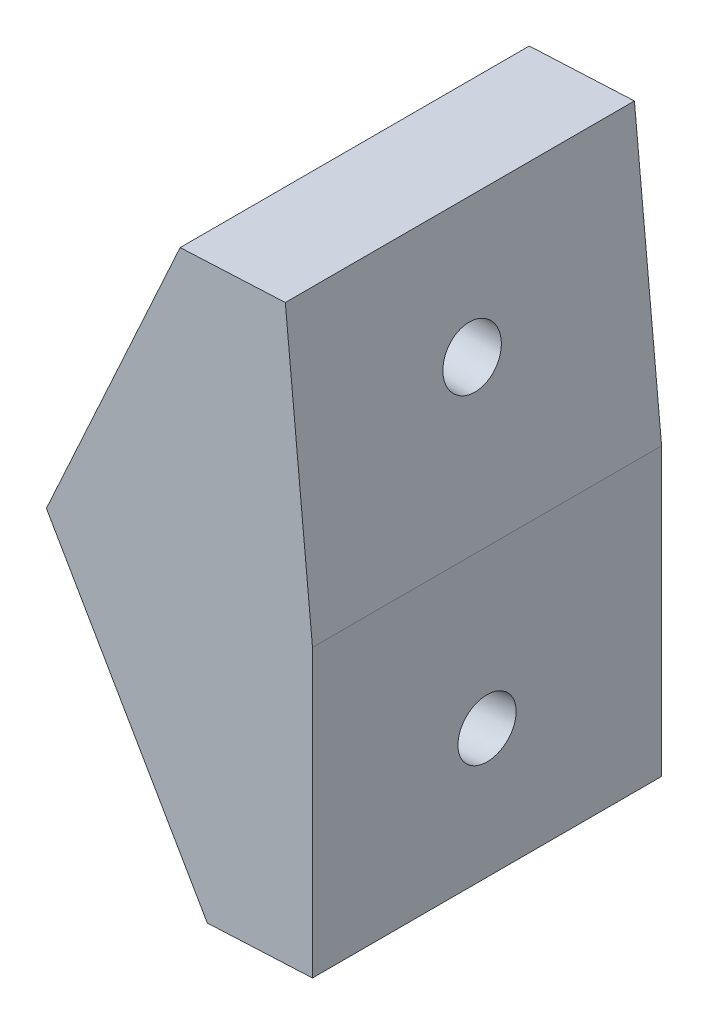
ISO-10303-21;
HEADER;
FILE_DESCRIPTION(('STEP AP214'),'2;1');
FILE_NAME('part.step','',(''),(''),'','','');
FILE_SCHEMA(('AUTOMOTIVE_DESIGN { 1 0 10303 214 1 1 1 1 }'));
ENDSEC;
DATA;
#1=APPLICATION_CONTEXT('core data for automotive mechanical design processes');
#2=APPLICATION_PROTOCOL_DEFINITION('international standard','automotive_design',2000,#1);
#3=PRODUCT_CONTEXT('',#1,'mechanical');
#4=PRODUCT('Part','Part','',(#3));
#5=PRODUCT_RELATED_PRODUCT_CATEGORY('part','',(#4));
#6=PRODUCT_DEFINITION_FORMATION('','',#4);
#7=PRODUCT_DEFINITION_CONTEXT('part definition',#1,'design');
#8=PRODUCT_DEFINITION('design','',#6,#7);
#9=PRODUCT_DEFINITION_SHAPE('','',#8);
#10=(LENGTH_UNIT() NAMED_UNIT(*) SI_UNIT(.MILLI.,.METRE.));
#11=(NAMED_UNIT(*) PLANE_ANGLE_UNIT() SI_UNIT($,.RADIAN.));
#12=(NAMED_UNIT(*) SI_UNIT($,.STERADIAN.) SOLID_ANGLE_UNIT());
#13=UNCERTAINTY_MEASURE_WITH_UNIT(LENGTH_MEASURE(1.E-05),#10,'distance_accuracy_value','');
#14=(GEOMETRIC_REPRESENTATION_CONTEXT(3) GLOBAL_UNCERTAINTY_ASSIGNED_CONTEXT((#13)) GLOBAL_UNIT_ASSIGNED_CONTEXT((#10,
#11,#12)) REPRESENTATION_CONTEXT('',''));
#15=CARTESIAN_POINT('',(0.,0.,0.));
#16=DIRECTION('',(0.,0.,1.));
#17=DIRECTION('',(1.,0.,0.));
#18=AXIS2_PLACEMENT_3D('',#15,#16,#17);
#19=CARTESIAN_POINT('',(-3.53030000000001,20.3447220636834,7.5));
#20=DIRECTION('',(-1.,0.,0.));
#21=DIRECTION('',(0.,-1.,0.));
#22=AXIS2_PLACEMENT_3D('',#19,#20,#21);
#23=PLANE('',#22);
#24=DIRECTION('',(0.,1.,0.));
#25=VECTOR('',#24,1.);
#26=CARTESIAN_POINT('',(-3.53030000000001,20.3447220636834,-7.5));
#27=LINE('',#26,#25);
#28=CARTESIAN_POINT('',(-3.5303,8.04169602348681,-7.5));
#29=VERTEX_POINT('',#28);
#30=CARTESIAN_POINT('',(-3.53030000000001,20.3447220636834,-7.5));
#31=VERTEX_POINT('',#30);
#32=EDGE_CURVE('E143',#29,#31,#27,.T.);
#33=ORIENTED_EDGE('',*,*,#32,.T.);
#34=DIRECTION('',(0.,0.,-1.));
#35=VECTOR('',#34,1.);
#36=CARTESIAN_POINT('',(-3.53030000000001,20.3447220636834,7.5));
#37=LINE('',#36,#35);
#38=CARTESIAN_POINT('',(-3.53030000000001,20.3447220636834,7.5));
#39=VERTEX_POINT('',#38);
#40=EDGE_CURVE('E140',#39,#31,#37,.T.);
#41=ORIENTED_EDGE('',*,*,#40,.F.);
#42=DIRECTION('',(0.,1.,0.));
#43=VECTOR('',#42,1.);
#44=CARTESIAN_POINT('',(-3.53030000000001,20.3447220636834,7.5));
#45=LINE('',#44,#43);
#46=CARTESIAN_POINT('',(-3.5303,8.04169602348681,7.5));
#47=VERTEX_POINT('',#46);
#48=EDGE_CURVE('E85',#47,#39,#45,.T.);
#49=ORIENTED_EDGE('',*,*,#48,.F.);
#50=DIRECTION('',(0.,0.,-1.));
#51=VECTOR('',#50,1.);
#52=CARTESIAN_POINT('',(-3.5303,8.04169602348681,7.5));
#53=LINE('',#52,#51);
#54=EDGE_CURVE('E52',#47,#29,#53,.T.);
#55=ORIENTED_EDGE('',*,*,#54,.T.);
#56=EDGE_LOOP('',(#33,#41,#49,#55));
#57=FACE_BOUND('',#56,.T.);
#58=CARTESIAN_POINT('',(-3.53029999999999,14.8337738265312,0.));
#59=CARTESIAN_POINT('',(-3.53029999999998,14.83377044408,0.0692359749450587));
#60=CARTESIAN_POINT('',(-3.53029999999998,14.82800026885,0.13854463497285));
#61=CARTESIAN_POINT('',(-3.53029999999999,14.8050706943426,0.275212221597939));
#62=CARTESIAN_POINT('',(-3.5303,14.7879112953292,0.342571148240443));
#63=CARTESIAN_POINT('',(-3.53029999999999,14.7426805167584,0.473530581182184));
#64=CARTESIAN_POINT('',(-3.53029999999998,14.7146091372099,0.537131087484525));
#65=CARTESIAN_POINT('',(-3.53029999999999,14.6483275840726,0.658806319649011));
#66=CARTESIAN_POINT('',(-3.53030000000002,14.6101174104955,0.716881045517602));
#67=CARTESIAN_POINT('',(-3.53030000000003,14.5246124435633,0.825906468855542));
#68=CARTESIAN_POINT('',(-3.5303,14.4773176502207,0.876857166334717));
#69=CARTESIAN_POINT('',(-3.53029999999999,14.3749478226641,0.970228300777369));
#70=CARTESIAN_POINT('',(-3.53030000000001,14.3198727884614,1.01264873775314));
#71=CARTESIAN_POINT('',(-3.53030000000002,14.2034615431487,1.08778959491427));
#72=CARTESIAN_POINT('',(-3.53030000000001,14.142125332047,1.12051001511267));
#73=CARTESIAN_POINT('',(-3.53030000000001,14.0148834613635,1.1753483006496));
#74=CARTESIAN_POINT('',(-3.53030000000001,13.9489778017867,1.19746616599979));
#75=CARTESIAN_POINT('',(-3.53030000000001,13.8144147998254,1.23048932199295));
#76=CARTESIAN_POINT('',(-3.53030000000001,13.7457574574429,1.24139461264418));
#77=CARTESIAN_POINT('',(-3.53030000000001,13.6075847479378,1.25169183310402));
#78=CARTESIAN_POINT('',(-3.5303,13.5380693808153,1.251083762916));
#79=CARTESIAN_POINT('',(-3.53029999999999,13.4000979455833,1.23837103432999));
#80=CARTESIAN_POINT('',(-3.53029999999998,13.3316418774741,1.22626637592988));
#81=CARTESIAN_POINT('',(-3.53029999999998,13.197677147345,1.1908943318853));
#82=CARTESIAN_POINT('',(-3.53029999999999,13.1321684853272,1.16762694623366));
#83=CARTESIAN_POINT('',(-3.5303,13.0059053819735,1.11057119105747));
#84=CARTESIAN_POINT('',(-3.5303,12.9451509406425,1.07678282152211));
#85=CARTESIAN_POINT('',(-3.5303,12.8300719666958,0.999617024174008));
#86=CARTESIAN_POINT('',(-3.5303,12.7757474340884,0.956239596348781));
#87=CARTESIAN_POINT('',(-3.5303,12.6750266214041,0.86109208724944));
#88=CARTESIAN_POINT('',(-3.5303,12.6286303413387,0.809322005963298));
#89=CARTESIAN_POINT('',(-3.5303,12.5450457067597,0.698817076073706));
#90=CARTESIAN_POINT('',(-3.53029999999999,12.507857352259,0.640082227460454));
#91=CARTESIAN_POINT('',(-3.53029999999998,12.4437142754655,0.517267747720645));
#92=CARTESIAN_POINT('',(-3.53029999999998,12.4167595531852,0.453188116587528));
#93=CARTESIAN_POINT('',(-3.53029999999999,12.3738271903862,0.32145147467509));
#94=CARTESIAN_POINT('',(-3.53029999999999,12.3578495497686,0.253794463928009));
#95=CARTESIAN_POINT('',(-3.53029999999998,12.3373120366163,0.11676913844667));
#96=CARTESIAN_POINT('',(-3.53029999999998,12.3327521633923,0.0474008238157425));
#97=CARTESIAN_POINT('',(-3.53029999999999,12.3351759508386,-0.0911338410326387));
#98=CARTESIAN_POINT('',(-3.53030000000001,12.3421596115093,-0.160300191250087));
#99=CARTESIAN_POINT('',(-3.53030000000001,12.3674778474107,-0.296523225390453));
#100=CARTESIAN_POINT('',(-3.5303,12.3858124226364,-0.363579909314306));
#101=CARTESIAN_POINT('',(-3.53029999999999,12.4333267940165,-0.493734097020736));
#102=CARTESIAN_POINT('',(-3.53029999999999,12.4625065901614,-0.556831600806745));
#103=CARTESIAN_POINT('',(-3.5303,12.5309065835864,-0.677327114878901));
#104=CARTESIAN_POINT('',(-3.53030000000001,12.5701267808545,-0.734725125171862));
#105=CARTESIAN_POINT('',(-3.53030000000001,12.6575258291469,-0.84223853969923));
#106=CARTESIAN_POINT('',(-3.5303,12.7057046801586,-0.892353943943785));
#107=CARTESIAN_POINT('',(-3.53029999999999,12.8096921975871,-0.983919898821573));
#108=CARTESIAN_POINT('',(-3.5303,12.8655008639928,-1.02537044946727));
#109=CARTESIAN_POINT('',(-3.5303,12.9832087344617,-1.09846343841363));
#110=CARTESIAN_POINT('',(-3.5303,13.0451079385167,-1.1301058767273));
#111=CARTESIAN_POINT('',(-3.5303,13.1732896226563,-1.18270990313287));
#112=CARTESIAN_POINT('',(-3.53029999999999,13.2395721027361,-1.20367149123618));
#113=CARTESIAN_POINT('',(-3.5303,13.3746921818933,-1.23433567080856));
#114=CARTESIAN_POINT('',(-3.53030000000001,13.443529780969,-1.24403826228543));
#115=CARTESIAN_POINT('',(-3.53030000000001,13.5818614681914,-1.25191683944832));
#116=CARTESIAN_POINT('',(-3.5303,13.6513555563379,-1.25009282513714));
#117=CARTESIAN_POINT('',(-3.53029999999999,13.7890834854926,-1.23496849873415));
#118=CARTESIAN_POINT('',(-3.5303,13.8573173265005,-1.22166818663966));
#119=CARTESIAN_POINT('',(-3.5303,13.9906427827779,-1.18395810552632));
#120=CARTESIAN_POINT('',(-3.5303,14.0557343980453,-1.15954833649986));
#121=CARTESIAN_POINT('',(-3.5303,14.1809800948796,-1.10029258567404));
#122=CARTESIAN_POINT('',(-3.5303,14.2411341764414,-1.06544660386359));
#123=CARTESIAN_POINT('',(-3.5303,14.3548456625534,-0.986279550979464));
#124=CARTESIAN_POINT('',(-3.5303,14.408403067095,-0.941958479893259));
#125=CARTESIAN_POINT('',(-3.5303,14.507444066479,-0.845063576805854));
#126=CARTESIAN_POINT('',(-3.5303,14.5529276613098,-0.792489744792787));
#127=CARTESIAN_POINT('',(-3.53029999999999,14.6345663450336,-0.680539759897578));
#128=CARTESIAN_POINT('',(-3.53029999999999,14.6707214339136,-0.621163607005943));
#129=CARTESIAN_POINT('',(-3.53029999999998,14.7327066309919,-0.497245214379639));
#130=CARTESIAN_POINT('',(-3.53029999999998,14.7585367391777,-0.432702974638769));
#131=CARTESIAN_POINT('',(-3.53030000000001,14.7968221512422,-0.307851428616006));
#132=CARTESIAN_POINT('',(-3.53030000000003,14.8104735895919,-0.247908385541222));
#133=CARTESIAN_POINT('',(-3.53030000000002,14.8243424429205,-0.156423425380291));
#134=CARTESIAN_POINT('',(-3.53030000000002,14.8278648106663,-0.125352889850853));
#135=CARTESIAN_POINT('',(-3.5303,14.8325879190164,-0.0628605600363315));
#136=CARTESIAN_POINT('',(-3.5303,14.8337753623908,-0.0314377730092758));
#137=CARTESIAN_POINT('',(-3.53029999999999,14.8337738265312,0.));
#138=B_SPLINE_CURVE_WITH_KNOTS('',3,(#58,#59,#60,#61,#62,#63,#64,#65,#66,#67,#68,#69,#70,#71,
#72,#73,#74,#75,#76,#77,#78,#79,#80,#81,#82,#83,#84,#85,#86,#87,#88,#89,#90,#91,#92,#93,#94,#95,
#96,#97,#98,#99,#100,#101,#102,#103,#104,#105,#106,#107,#108,#109,#110,#111,#112,#113,#114,#115,
#116,#117,#118,#119,#120,#121,#122,#123,#124,#125,#126,#127,#128,#129,#130,#131,#132,#133,#134,
#135,#136,#137),.UNSPECIFIED.,.T.,.F.,(4,2,2,2,2,2,2,2,2,2,2,2,2,2,2,2,2,2,2,2,2,2,2,2,2,2,2,2,
2,2,2,2,2,2,2,2,2,2,2,4),(0.,0.207595387613271,0.415190770413107,0.6227861530415,
0.83038153542772,1.03797691752757,1.24557229932822,1.45316768084964,1.66076306214237,
1.86835844328203,2.07595382436099,2.2835492054783,2.49114458672877,2.69873996819264,
2.90633534992677,3.11393073195841,3.32152611428222,3.52912149686082,3.73671687756856,
3.94431224574143,4.1519076139204,4.35950298200743,4.56709834991453,4.77469371757345,
4.98228908494311,5.18988445201415,5.3974798188099,5.60507518538387,5.81267055181385,
6.02026591819344,6.22786128462173,6.43545665119248,6.64305201798384,6.85064738504981,
7.05824275241428,7.26583812006845,7.47343348797176,7.65716557528975,7.75089553776605,
7.84515775735252),.UNSPECIFIED.);
#139=CARTESIAN_POINT('',(-3.53029999999999,14.8337738265312,0.));
#140=VERTEX_POINT('',#139);
#141=EDGE_CURVE('E158',#140,#140,#138,.T.);
#142=ORIENTED_EDGE('',*,*,#141,.F.);
#143=EDGE_LOOP('',(#142));
#144=FACE_BOUND('',#143,.T.);
#145=ADVANCED_FACE('F38',(#57,#144),#23,.F.);
#146=CARTESIAN_POINT('',(-8.04908347678806,7.82676257019965,7.5));
#147=DIRECTION('',(0.866025403784439,0.499999999999999,0.));
#148=DIRECTION('',(-0.499999999999999,0.866025403784439,0.));
#149=AXIS2_PLACEMENT_3D('',#146,#147,#148);
#150=PLANE('',#149);
#151=DIRECTION('',(0.499999999999999,-0.866025403784439,0.));
#152=VECTOR('',#151,1.);
#153=CARTESIAN_POINT('',(-8.04908347678806,7.82676257019965,-7.5));
#154=LINE('',#153,#152);
#155=CARTESIAN_POINT('',(-14.9625241732557,19.801193111596,-7.5));
#156=VERTEX_POINT('',#155);
#157=CARTESIAN_POINT('',(-8.04908347678806,7.82676257019965,-7.5));
#158=VERTEX_POINT('',#157);
#159=EDGE_CURVE('E75',#156,#158,#154,.T.);
#160=ORIENTED_EDGE('',*,*,#159,.T.);
#161=DIRECTION('',(0.,0.,-1.));
#162=VECTOR('',#161,1.);
#163=CARTESIAN_POINT('',(-8.04908347678806,7.82676257019965,7.5));
#164=LINE('',#163,#162);
#165=CARTESIAN_POINT('',(-8.04908347678806,7.82676257019965,7.5));
#166=VERTEX_POINT('',#165);
#167=EDGE_CURVE('E11',#166,#158,#164,.T.);
#168=ORIENTED_EDGE('',*,*,#167,.F.);
#169=DIRECTION('',(0.499999999999999,-0.866025403784439,0.));
#170=VECTOR('',#169,1.);
#171=CARTESIAN_POINT('',(-8.04908347678806,7.82676257019965,7.5));
#172=LINE('',#171,#170);
#173=CARTESIAN_POINT('',(-14.9625241732557,19.801193111596,7.5));
#174=VERTEX_POINT('',#173);
#175=EDGE_CURVE('E145',#174,#166,#172,.T.);
#176=ORIENTED_EDGE('',*,*,#175,.F.);
#177=DIRECTION('',(0.,0.,-1.));
#178=VECTOR('',#177,1.);
#179=CARTESIAN_POINT('',(-14.9625241732557,19.801193111596,7.5));
#180=LINE('',#179,#178);
#181=EDGE_CURVE('E123',#174,#156,#180,.T.);
#182=ORIENTED_EDGE('',*,*,#181,.T.);
#183=EDGE_LOOP('',(#160,#168,#176,#182));
#184=FACE_BOUND('',#183,.T.);
#185=CARTESIAN_POINT('',(-11.5362060057165,13.8666359625219,0.));
#186=CARTESIAN_POINT('',(-11.5362072752324,13.8666381613879,-0.0326198939663583));
#187=CARTESIAN_POINT('',(-11.5355182785105,13.8654447840593,-0.0652250456816861));
#188=CARTESIAN_POINT('',(-11.5314150249022,13.8583377403332,-0.16205908641741));
#189=CARTESIAN_POINT('',(-11.5259932305843,13.8489469171063,-0.226000532693163));
#190=CARTESIAN_POINT('',(-11.5098582972801,13.8210003928472,-0.352029052524314));
#191=CARTESIAN_POINT('',(-11.499074095043,13.802321606654,-0.414079007472181));
#192=CARTESIAN_POINT('',(-11.4725828744128,13.7564374665664,-0.533850540239035));
#193=CARTESIAN_POINT('',(-11.4568756210475,13.7292317056881,-0.591571911296044));
#194=CARTESIAN_POINT('',(-11.4299153322568,13.6825351157171,-0.674263443295166));
#195=CARTESIAN_POINT('',(-11.4202683203303,13.6658260009204,-0.701385118926388));
#196=CARTESIAN_POINT('',(-11.3999330648122,13.6306043051793,-0.754007701911261));
#197=CARTESIAN_POINT('',(-11.3892451255692,13.6120922513817,-0.779509079429098));
#198=CARTESIAN_POINT('',(-11.3554858986797,13.5536195551844,-0.853945803852405));
#199=CARTESIAN_POINT('',(-11.3309167716207,13.5110645788209,-0.90021137942669));
#200=CARTESIAN_POINT('',(-11.278543549617,13.4203514973546,-0.984760317561986));
#201=CARTESIAN_POINT('',(-11.2507371653726,13.3721894270684,-1.02303797721228));
#202=CARTESIAN_POINT('',(-11.2058607079811,13.2944611228026,-1.07553033683071));
#203=CARTESIAN_POINT('',(-11.1896572678926,13.2663959413119,-1.09277291736579));
#204=CARTESIAN_POINT('',(-11.1566365804922,13.2092024330336,-1.124630156555));
#205=CARTESIAN_POINT('',(-11.1398199191548,13.1800751211835,-1.13924724877576));
#206=CARTESIAN_POINT('',(-11.0885884171327,13.0913395567332,-1.17909873663641));
#207=CARTESIAN_POINT('',(-11.0533765828705,13.0303508707634,-1.20035131526517));
#208=CARTESIAN_POINT('',(-10.9817712102416,12.9063267272752,-1.23189010289855));
#209=CARTESIAN_POINT('',(-10.9453777945875,12.8432914823014,-1.24217744696303));
#210=CARTESIAN_POINT('',(-10.8722297615048,12.7165953725284,-1.25168780732677));
#211=CARTESIAN_POINT('',(-10.8354751581202,12.6529345320542,-1.25091125213484));
#212=CARTESIAN_POINT('',(-10.7624417663058,12.5264369867827,-1.2382985488937));
#213=CARTESIAN_POINT('',(-10.7261629903772,12.4636003036379,-1.22646211086206));
#214=CARTESIAN_POINT('',(-10.6549223003874,12.3402078090093,-1.19186851095904));
#215=CARTESIAN_POINT('',(-10.619960506576,12.2796522058041,-1.16911035445179));
#216=CARTESIAN_POINT('',(-10.5522240390831,12.1623292025811,-1.11296785437691));
#217=CARTESIAN_POINT('',(-10.5194497053048,12.1055623912929,-1.07958186400884));
#218=CARTESIAN_POINT('',(-10.4569924637754,11.9973832756635,-1.00269112882337));
#219=CARTESIAN_POINT('',(-10.4273102223008,11.9459721253469,-0.959184209675706));
#220=CARTESIAN_POINT('',(-10.3727137618157,11.8514082818735,-0.86414556299923));
#221=CARTESIAN_POINT('',(-10.3476938687266,11.8080725558432,-0.812857582242533));
#222=CARTESIAN_POINT('',(-10.3031440798381,11.7309100580219,-0.704557486488847));
#223=CARTESIAN_POINT('',(-10.2834492885576,11.6967976788796,-0.647817096921525));
#224=CARTESIAN_POINT('',(-10.2496338641317,11.6382276456944,-0.530302248870885));
#225=CARTESIAN_POINT('',(-10.235360529589,11.613505505073,-0.469705349409906));
#226=CARTESIAN_POINT('',(-10.2180536204467,11.5835290591165,-0.376652290168916));
#227=CARTESIAN_POINT('',(-10.2130043813103,11.5747835203926,-0.345647258392102));
#228=CARTESIAN_POINT('',(-10.2042040298782,11.5595408645878,-0.282875887280493));
#229=CARTESIAN_POINT('',(-10.2004541773471,11.553045929483,-0.251108840885472));
#230=CARTESIAN_POINT('',(-10.1912201129372,11.5370520607648,-0.154968767433614));
#231=CARTESIAN_POINT('',(-10.1877545474358,11.5310495252394,-0.0897737248540003));
#232=CARTESIAN_POINT('',(-10.1863749864742,11.5286600555616,0.0408380455133362));
#233=CARTESIAN_POINT('',(-10.1884597458321,11.5322709646911,0.10625472029079));
#234=CARTESIAN_POINT('',(-10.1956308589824,11.5446916970142,0.202617473266373));
#235=CARTESIAN_POINT('',(-10.1986592858051,11.5499370861381,0.234223399992435));
#236=CARTESIAN_POINT('',(-10.2060041406211,11.5626587478538,0.29682638886882));
#237=CARTESIAN_POINT('',(-10.2103203884566,11.5701347084028,0.327823535537563));
#238=CARTESIAN_POINT('',(-10.2252749904835,11.5960368389204,0.420384764255338));
#239=CARTESIAN_POINT('',(-10.237860195496,11.6178350534253,0.48073251054241));
#240=CARTESIAN_POINT('',(-10.2677210980512,11.6695556538115,0.596599151210543));
#241=CARTESIAN_POINT('',(-10.2849988587737,11.699481613225,0.652115907336039));
#242=CARTESIAN_POINT('',(-10.3142770595166,11.7501929444653,0.731620303119884));
#243=CARTESIAN_POINT('',(-10.3247826644572,11.7683891859861,0.757859721049453));
#244=CARTESIAN_POINT('',(-10.3467940480171,11.8065140206562,0.808587395128292));
#245=CARTESIAN_POINT('',(-10.3582994946807,11.8264420388414,0.833076227602102));
#246=CARTESIAN_POINT('',(-10.3944607248445,11.8890751267496,0.904271492603993));
#247=CARTESIAN_POINT('',(-10.420545825896,11.9342558470913,0.948124725747563));
#248=CARTESIAN_POINT('',(-10.4757430346234,12.0298602170431,1.02744207539978));
#249=CARTESIAN_POINT('',(-10.5048572814408,12.0802875717549,1.06290020472069));
#250=CARTESIAN_POINT('',(-10.5516252801019,12.1612921216043,1.11082195382654));
#251=CARTESIAN_POINT('',(-10.5684931812569,12.1905081834218,1.12642395316151));
#252=CARTESIAN_POINT('',(-10.6027766020801,12.2498888101448,1.15489531129881));
#253=CARTESIAN_POINT('',(-10.6201915996955,12.2800524708283,1.16776718945632));
#254=CARTESIAN_POINT('',(-10.6731164416115,12.3717209860095,1.20223522851521));
#255=CARTESIAN_POINT('',(-10.7093219293958,12.4344307303647,1.21969986107764));
#256=CARTESIAN_POINT('',(-10.7826196963618,12.5613861868312,1.24332491802364));
#257=CARTESIAN_POINT('',(-10.8197119020999,12.6256317717343,1.24948627535273));
#258=CARTESIAN_POINT('',(-10.893936993122,12.754193400581,1.25045185330533));
#259=CARTESIAN_POINT('',(-10.9310698778174,12.8185094435051,1.24525623613271));
#260=CARTESIAN_POINT('',(-11.0045052782915,12.9457032882004,1.22356382345989));
#261=CARTESIAN_POINT('',(-11.0408077491047,13.0085810120891,1.20706641747731));
#262=CARTESIAN_POINT('',(-11.1116992140044,13.1313686311183,1.16297545104097));
#263=CARTESIAN_POINT('',(-11.1462879984339,13.1912781631224,1.13538053663583));
#264=CARTESIAN_POINT('',(-11.2128340417973,13.3065392912703,1.06948321585202));
#265=CARTESIAN_POINT('',(-11.2447908044238,13.3618900277849,1.03117879599236));
#266=CARTESIAN_POINT('',(-11.304575619689,13.4654403653454,0.945289858219037));
#267=CARTESIAN_POINT('',(-11.3324667490842,13.5137492185381,0.8978816350671));
#268=CARTESIAN_POINT('',(-11.3829015482548,13.6011048531712,0.79625736337649));
#269=CARTESIAN_POINT('',(-11.4056059155026,13.6404299707981,0.742361337942806));
#270=CARTESIAN_POINT('',(-11.4454686092965,13.7094741817756,0.62962547646572));
#271=CARTESIAN_POINT('',(-11.4627889479871,13.7394738883921,0.571015374045337));
#272=CARTESIAN_POINT('',(-11.4918547603036,13.7898173520876,0.450466897166818));
#273=CARTESIAN_POINT('',(-11.5037408445497,13.8104046539048,0.388664942163744));
#274=CARTESIAN_POINT('',(-11.5206378282234,13.8396710881223,0.272538314880943));
#275=CARTESIAN_POINT('',(-11.5264638959636,13.8497621334568,0.218681780315298));
#276=CARTESIAN_POINT('',(-11.5342455380701,13.8632403329517,0.109869029952719));
#277=CARTESIAN_POINT('',(-11.536203868563,13.8666322608634,0.0549136254328194));
#278=CARTESIAN_POINT('',(-11.5362060057165,13.8666359625219,0.));
#279=B_SPLINE_CURVE_WITH_KNOTS('',3,(#185,#186,#187,#188,#189,#190,#191,#192,#193,#194,#195,
#196,#197,#198,#199,#200,#201,#202,#203,#204,#205,#206,#207,#208,#209,#210,#211,#212,#213,#214,
#215,#216,#217,#218,#219,#220,#221,#222,#223,#224,#225,#226,#227,#228,#229,#230,#231,#232,#233,
#234,#235,#236,#237,#238,#239,#240,#241,#242,#243,#244,#245,#246,#247,#248,#249,#250,#251,#252,
#253,#254,#255,#256,#257,#258,#259,#260,#261,#262,#263,#264,#265,#266,#267,#268,#269,#270,#271,
#272,#273,#274,#275,#276,#277,#278),.UNSPECIFIED.,.T.,.F.,(4,2,2,2,2,2,2,2,2,2,2,2,2,2,2,2,2,2,
2,2,2,2,2,2,2,2,2,2,2,2,2,2,2,2,2,2,2,2,2,2,2,2,2,2,2,2,4),(0.,0.0978188642523053,
0.291393187893071,0.487604027811819,0.683824234104244,0.783587295340894,0.8833212747238,
1.08492602027114,1.28667421122805,1.39669574101748,1.50661475953079,1.72634660577679,
1.9460557043991,2.16575629363198,2.38546264342317,2.60518900556867,2.824949431264,
3.04475711287456,3.25872847574049,3.46501534282815,3.66496273287577,3.76269014215321,
3.86051203548135,4.05620930405391,4.25186267282961,4.34831086145121,4.44474556390595,
4.63997044192219,4.8352812939599,4.93603373293993,5.03675284815207,5.24033953728972,
5.44407098516471,5.55547182029031,5.66676940313128,5.88925942424757,6.11173108073938,
6.33419955984217,6.55668005684732,6.77918770582168,7.00173721634986,7.22034683401071,
7.43079951020402,7.63411293149388,7.83181761881676,7.9966072516082,8.16127941385859),.UNSPECIFIED.);
#280=CARTESIAN_POINT('',(-11.5362060057165,13.8666359625219,0.));
#281=VERTEX_POINT('',#280);
#282=EDGE_CURVE('E42',#281,#281,#279,.T.);
#283=ORIENTED_EDGE('',*,*,#282,.F.);
#284=EDGE_LOOP('',(#283));
#285=FACE_BOUND('',#284,.T.);
#286=ADVANCED_FACE('F184',(#184,#285),#150,.F.);
#287=CARTESIAN_POINT('',(-3.53030000000001,20.3447220636834,7.5));
#288=DIRECTION('',(-0.995489410249805,-0.0948727256933957,0.));
#289=DIRECTION('',(-0.0948727256933957,0.995489410249806,0.));
#290=AXIS2_PLACEMENT_3D('',#287,#288,#289);
#291=PLANE('',#290);
#292=DIRECTION('',(0.0948727256933957,-0.995489410249805,0.));
#293=VECTOR('',#292,1.);
#294=CARTESIAN_POINT('',(-3.53030000000001,20.3447220636834,-7.5));
#295=LINE('',#294,#293);
#296=CARTESIAN_POINT('',(-4.69752161471028,32.5922542007268,-7.5));
#297=VERTEX_POINT('',#296);
#298=EDGE_CURVE('E131',#297,#31,#295,.T.);
#299=ORIENTED_EDGE('',*,*,#298,.F.);
#300=DIRECTION('',(0.,0.,-1.));
#301=VECTOR('',#300,1.);
#302=CARTESIAN_POINT('',(-4.69752161471028,32.5922542007268,7.5));
#303=LINE('',#302,#301);
#304=CARTESIAN_POINT('',(-4.69752161471028,32.5922542007268,7.5));
#305=VERTEX_POINT('',#304);
#306=EDGE_CURVE('E114',#305,#297,#303,.T.);
#307=ORIENTED_EDGE('',*,*,#306,.F.);
#308=DIRECTION('',(0.0948727256933957,-0.995489410249805,0.));
#309=VECTOR('',#308,1.);
#310=CARTESIAN_POINT('',(-3.53030000000001,20.3447220636834,7.5));
#311=LINE('',#310,#309);
#312=EDGE_CURVE('E110',#305,#39,#311,.T.);
#313=ORIENTED_EDGE('',*,*,#312,.T.);
#314=ORIENTED_EDGE('',*,*,#40,.T.);
#315=EDGE_LOOP('',(#299,#307,#313,#314));
#316=FACE_BOUND('',#315,.T.);
#317=CARTESIAN_POINT('',(-4.29036185351228,28.3199701739947,0.));
#318=CARTESIAN_POINT('',(-4.29036153260945,28.3199668067956,0.0692360020484546));
#319=CARTESIAN_POINT('',(-4.28981410021557,28.3142226569676,0.138544689893116));
#320=CARTESIAN_POINT('',(-4.28763870833981,28.2913965016142,0.275212333058115));
#321=CARTESIAN_POINT('',(-4.28601074885782,28.2743144960876,0.342571288378252));
#322=CARTESIAN_POINT('',(-4.28171958010857,28.2292877192531,0.473530775549609));
#323=CARTESIAN_POINT('',(-4.27905637086963,28.2013429482424,0.537131307503654));
#324=CARTESIAN_POINT('',(-4.27276805690169,28.1353603392507,0.65880658492782));
#325=CARTESIAN_POINT('',(-4.26914295221635,28.0973225017278,0.716881330648737));
#326=CARTESIAN_POINT('',(-4.2610308597689,28.0122031793158,0.825906785033002));
#327=CARTESIAN_POINT('',(-4.25654387205201,27.9651216949011,0.876857494070101));
#328=CARTESIAN_POINT('',(-4.24683176361939,27.8632135750995,0.970228640222225));
#329=CARTESIAN_POINT('',(-4.24160664294337,27.8083869401292,1.01264907779611));
#330=CARTESIAN_POINT('',(-4.23056238651011,27.6925007331816,1.08778992225705));
#331=CARTESIAN_POINT('',(-4.2247432507821,27.6314411615111,1.12051032962161));
#332=CARTESIAN_POINT('',(-4.21267146339282,27.504773181636,1.17534857374963));
#333=CARTESIAN_POINT('',(-4.20641881174857,27.43916477361,1.19746641092943));
#334=CARTESIAN_POINT('',(-4.19365244923611,27.3052086909143,1.2304894940281));
#335=CARTESIAN_POINT('',(-4.18713873837443,27.236861016313,1.24139474022736));
#336=CARTESIAN_POINT('',(-4.17402991428565,27.0993115207564,1.25169185572691));
#337=CARTESIAN_POINT('',(-4.16743480105921,27.030109699808,1.25108372511939));
#338=CARTESIAN_POINT('',(-4.1543450743809,26.8927605913463,1.23837086161708));
#339=CARTESIAN_POINT('',(-4.14785046092903,26.8246133038329,1.22626612872285));
#340=CARTESIAN_POINT('',(-4.13514086405142,26.6912528568999,1.19089392548454));
#341=CARTESIAN_POINT('',(-4.12892588062563,26.6260396974799,1.16762645514234));
#342=CARTESIAN_POINT('',(-4.11694696146048,26.5003461739936,1.11057052587767));
#343=CARTESIAN_POINT('',(-4.111183025721,26.4398658099261,1.07678206695804));
#344=CARTESIAN_POINT('',(-4.10026517905509,26.3253060072093,0.999616092442714));
#345=CARTESIAN_POINT('',(-4.09511126812846,26.2712265685578,0.956238576850298));
#346=CARTESIAN_POINT('',(-4.08555562287793,26.1709602002683,0.861090899981629));
#347=CARTESIAN_POINT('',(-4.08115388855376,26.1247732706274,0.809320738708532));
#348=CARTESIAN_POINT('',(-4.07322400222899,26.0415658176626,0.698815661746283));
#349=CARTESIAN_POINT('',(-4.06969585022808,26.0045452943354,0.640080746059702));
#350=CARTESIAN_POINT('',(-4.06361043968056,25.9406917293323,0.517266148564584));
#351=CARTESIAN_POINT('',(-4.06105318113364,25.9138586876532,0.453186466757767));
#352=CARTESIAN_POINT('',(-4.05698009007726,25.8711201768328,0.321449740857277));
#353=CARTESIAN_POINT('',(-4.05546425756756,25.8552147076888,0.253792696764459));
#354=CARTESIAN_POINT('',(-4.05351582725151,25.8347700358187,0.116767318344555));
#355=CARTESIAN_POINT('',(-4.05308322944502,25.8302308330911,0.0473989840176922));
#356=CARTESIAN_POINT('',(-4.05331320015428,25.8326438912599,-0.0911357032637368));
#357=CARTESIAN_POINT('',(-4.05397576867002,25.8395961521563,-0.160302056218305));
#358=CARTESIAN_POINT('',(-4.0563777975083,25.8648003850288,-0.296525080051291));
#359=CARTESIAN_POINT('',(-4.05811725783097,25.8830523570062,-0.363581750929464));
#360=CARTESIAN_POINT('',(-4.06262509366494,25.9303525984935,-0.493735897616138));
#361=CARTESIAN_POINT('',(-4.06539346917647,25.9594008680058,-0.556833373423739));
#362=CARTESIAN_POINT('',(-4.07188277991611,26.0274925147242,-0.677328816639043));
#363=CARTESIAN_POINT('',(-4.07560371514452,26.0665358919334,-0.734726784044958));
#364=CARTESIAN_POINT('',(-4.08389551696463,26.1535408856604,-0.84224009693624));
#365=CARTESIAN_POINT('',(-4.08846638355666,26.2015025021815,-0.892355442418945));
#366=CARTESIAN_POINT('',(-4.0983319774831,26.3050211289293,-0.983921262195916));
#367=CARTESIAN_POINT('',(-4.10362670481779,26.3605781391588,-1.02537173648691));
#368=CARTESIAN_POINT('',(-4.11479398452788,26.4777552162527,-1.09846455326541));
#369=CARTESIAN_POINT('',(-4.12066653690347,26.5393752831193,-1.1301068957495));
#370=CARTESIAN_POINT('',(-4.13282749376855,26.6669789088106,-1.18271070978752));
#371=CARTESIAN_POINT('',(-4.13911589825816,26.7329624676365,-1.20367218133845));
#372=CARTESIAN_POINT('',(-4.15193511663644,26.8674731613052,-1.23433610728953));
#373=CARTESIAN_POINT('',(-4.15846593052516,26.9360002961484,-1.24403856168764));
#374=CARTESIAN_POINT('',(-4.17158983898088,27.0737080703614,-1.25191684642699));
#375=CARTESIAN_POINT('',(-4.17818293354788,27.1428887097313,-1.25009267676751));
#376=CARTESIAN_POINT('',(-4.19124955688165,27.2799953972585,-1.23496802596801));
#377=CARTESIAN_POINT('',(-4.19772308564843,27.3479214454158,-1.22166754482871));
#378=CARTESIAN_POINT('',(-4.21037202857722,27.4806454569211,-1.18395711862441));
#379=CARTESIAN_POINT('',(-4.21654744273929,27.5454434202695,-1.15954717356142));
#380=CARTESIAN_POINT('',(-4.22842983053406,27.6701240503634,-1.10029107187559));
#381=CARTESIAN_POINT('',(-4.23413680416689,27.7300067171101,-1.06544491525566));
#382=CARTESIAN_POINT('',(-4.24492490353342,27.8432050952278,-0.986277522811472));
#383=CARTESIAN_POINT('',(-4.25000602926733,27.8965208066009,-0.941956286990502));
#384=CARTESIAN_POINT('',(-4.2594022935563,27.9951148074291,-0.845061072828932));
#385=CARTESIAN_POINT('',(-4.26371743211164,28.0403930968871,-0.792487094491444));
#386=CARTESIAN_POINT('',(-4.27146268611755,28.1216632225868,-0.680536842650492));
#387=CARTESIAN_POINT('',(-4.27489280156845,28.1576550588318,-0.621160569149517));
#388=CARTESIAN_POINT('',(-4.28077347176235,28.2193603051016,-0.497241965104409));
#389=CARTESIAN_POINT('',(-4.28322402650566,28.2450737151297,-0.432699634561902));
#390=CARTESIAN_POINT('',(-4.28685621670355,28.2831859001819,-0.307848511635154));
#391=CARTESIAN_POINT('',(-4.28815134064269,28.2967754977921,-0.247906003851343));
#392=CARTESIAN_POINT('',(-4.28946709051441,28.3105815211172,-0.156421892502936));
#393=CARTESIAN_POINT('',(-4.28980126042259,28.3140879303869,-0.125351656955264));
#394=CARTESIAN_POINT('',(-4.29024934552294,28.3187896396404,-0.0628599380053494));
#395=CARTESIAN_POINT('',(-4.29036199922217,28.3199717029131,-0.0314374619131726));
#396=CARTESIAN_POINT('',(-4.29036185351228,28.3199701739947,0.));
#397=B_SPLINE_CURVE_WITH_KNOTS('',3,(#317,#318,#319,#320,#321,#322,#323,#324,#325,#326,#327,
#328,#329,#330,#331,#332,#333,#334,#335,#336,#337,#338,#339,#340,#341,#342,#343,#344,#345,#346,
#347,#348,#349,#350,#351,#352,#353,#354,#355,#356,#357,#358,#359,#360,#361,#362,#363,#364,#365,
#366,#367,#368,#369,#370,#371,#372,#373,#374,#375,#376,#377,#378,#379,#380,#381,#382,#383,#384,
#385,#386,#387,#388,#389,#390,#391,#392,#393,#394,#395,#396),.UNSPECIFIED.,.T.,.F.,(4,2,2,2,2,2,
2,2,2,2,2,2,2,2,2,2,2,2,2,2,2,2,2,2,2,2,2,2,2,2,2,2,2,2,2,2,2,2,2,4),(0.,0.207595470118391,
0.41519094025827,0.622786404718687,0.83038185975712,1.0379773039044,1.24557273688468,
1.4531681596456,1.66076357425448,1.86835898367183,2.07595439142694,2.283549799172,
2.49114520688213,2.69874061453629,2.90633602211956,3.11393142962479,3.32152683705339,
3.52912224441517,3.73671765172723,3.94431305901215,4.15190846629548,4.35950387360292,
4.56709928095755,4.77469468837728,4.98229009587287,5.1898855034468,5.39748091109292,
5.60507631879722,5.81267172653928,6.02026713429456,6.22786254203707,6.43545794974221,
6.64305335738949,6.85064876496474,7.05824417246169,7.26583957988267,7.47343498723829,
7.65716535355943,7.75089440007402,7.84515568744042),.UNSPECIFIED.);
#398=CARTESIAN_POINT('',(-4.29036185351228,28.3199701739947,0.));
#399=VERTEX_POINT('',#398);
#400=EDGE_CURVE('E135',#399,#399,#397,.T.);
#401=ORIENTED_EDGE('',*,*,#400,.F.);
#402=EDGE_LOOP('',(#401));
#403=FACE_BOUND('',#402,.T.);
#404=ADVANCED_FACE('F180',(#316,#403),#291,.F.);
#405=CARTESIAN_POINT('',(-9.21631403562064,32.3775088721214,7.5));
#406=DIRECTION('',(0.909555481321419,-0.415582514548148,0.));
#407=DIRECTION('',(-0.415582514548148,-0.909555481321419,0.));
#408=AXIS2_PLACEMENT_3D('',#405,#406,#407);
#409=PLANE('',#408);
#410=DIRECTION('',(0.415582514548148,0.909555481321419,0.));
#411=VECTOR('',#410,1.);
#412=CARTESIAN_POINT('',(-9.21631403562064,32.3775088721214,-7.5));
#413=LINE('',#412,#411);
#414=CARTESIAN_POINT('',(-9.21631403562064,32.3775088721214,-7.5));
#415=VERTEX_POINT('',#414);
#416=EDGE_CURVE('E134',#156,#415,#413,.T.);
#417=ORIENTED_EDGE('',*,*,#416,.F.);
#418=ORIENTED_EDGE('',*,*,#181,.F.);
#419=DIRECTION('',(0.415582514548148,0.909555481321419,0.));
#420=VECTOR('',#419,1.);
#421=CARTESIAN_POINT('',(-9.21631403562064,32.3775088721214,7.5));
#422=LINE('',#421,#420);
#423=CARTESIAN_POINT('',(-9.21631403562064,32.3775088721214,7.5));
#424=VERTEX_POINT('',#423);
#425=EDGE_CURVE('E107',#174,#424,#422,.T.);
#426=ORIENTED_EDGE('',*,*,#425,.T.);
#427=DIRECTION('',(0.,0.,-1.));
#428=VECTOR('',#427,1.);
#429=CARTESIAN_POINT('',(-9.21631403562064,32.3775088721214,7.5));
#430=LINE('',#429,#428);
#431=EDGE_CURVE('E117',#424,#415,#430,.T.);
#432=ORIENTED_EDGE('',*,*,#431,.T.);
#433=EDGE_LOOP('',(#417,#418,#426,#432));
#434=FACE_BOUND('',#433,.T.);
#435=CARTESIAN_POINT('',(-10.9930863931103,28.4888153389678,0.));
#436=CARTESIAN_POINT('',(-10.9930853376448,28.4888176489891,-0.0326196576215252));
#437=CARTESIAN_POINT('',(-10.993658005319,28.4875642925465,-0.0652245696836439));
#438=CARTESIAN_POINT('',(-10.9970684666651,28.4801000617316,-0.162057763647457));
#439=CARTESIAN_POINT('',(-11.0015748380799,28.4702372915769,-0.225998606302907));
#440=CARTESIAN_POINT('',(-11.0149855161708,28.4408863075038,-0.352025925565319));
#441=CARTESIAN_POINT('',(-11.0239488870006,28.4212688241311,-0.414075284207859));
#442=CARTESIAN_POINT('',(-11.0459672474623,28.3730788263633,-0.533845683145573));
#443=CARTESIAN_POINT('',(-11.0590224325464,28.3445058841957,-0.591566516518252));
#444=CARTESIAN_POINT('',(-11.081430662938,28.2954626062299,-0.674257420449693));
#445=CARTESIAN_POINT('',(-11.0894488626561,28.2779137507126,-0.701378961012347));
#446=CARTESIAN_POINT('',(-11.1063506881748,28.2409219440167,-0.754001294312761));
#447=CARTESIAN_POINT('',(-11.1152340609861,28.2214795465374,-0.779502557260691));
#448=CARTESIAN_POINT('',(-11.1432933221092,28.1600682651114,-0.853938961134171));
#449=CARTESIAN_POINT('',(-11.1637141459082,28.1153746806387,-0.900204374542527));
#450=CARTESIAN_POINT('',(-11.2072445468813,28.0201028310707,-0.984753161982544));
#451=CARTESIAN_POINT('',(-11.2303560269412,27.9695204012665,-1.02303083284147));
#452=CARTESIAN_POINT('',(-11.267655580439,27.8878855582517,-1.07552361254331));
#453=CARTESIAN_POINT('',(-11.2811233553738,27.8584096104332,-1.09276649107869));
#454=CARTESIAN_POINT('',(-11.3085690868775,27.7983411170434,-1.12462433437434));
#455=CARTESIAN_POINT('',(-11.3225465564033,27.7677496374283,-1.13924173267148));
#456=CARTESIAN_POINT('',(-11.3651285441119,27.6745535115805,-1.17909415794061));
#457=CARTESIAN_POINT('',(-11.3943955046345,27.6104990255687,-1.20034738794373));
#458=CARTESIAN_POINT('',(-11.4539116479656,27.4802403344571,-1.23188755981539));
#459=CARTESIAN_POINT('',(-11.4841607287622,27.4140363526235,-1.2421756368938));
#460=CARTESIAN_POINT('',(-11.5449591528973,27.2809712259834,-1.25168755627445));
#461=CARTESIAN_POINT('',(-11.5755084845586,27.2141101067337,-1.25091182717306));
#462=CARTESIAN_POINT('',(-11.6362117274278,27.0812532964666,-1.23830085849199));
#463=CARTESIAN_POINT('',(-11.6663656282477,27.0152576281845,-1.22646532895952));
#464=CARTESIAN_POINT('',(-11.7255789756526,26.8856616446815,-1.19187359398335));
#465=CARTESIAN_POINT('',(-11.7546383222931,26.822061548202,-1.16911639386854));
#466=CARTESIAN_POINT('',(-11.8109392429492,26.6988397831047,-1.11297579634152));
#467=CARTESIAN_POINT('',(-11.8381805344423,26.6392187328236,-1.0795907520111));
#468=CARTESIAN_POINT('',(-11.890093717256,26.5256000931357,-1.00270182092629));
#469=CARTESIAN_POINT('',(-11.9147650547574,26.4716037158331,-0.959195759620212));
#470=CARTESIAN_POINT('',(-11.9601448088829,26.3722843203798,-0.864158554367558));
#471=CARTESIAN_POINT('',(-11.980941051035,26.3267690848294,-0.812871147270801));
#472=CARTESIAN_POINT('',(-12.0179703454716,26.2457257383333,-0.70457220287727));
#473=CARTESIAN_POINT('',(-12.0343404715743,26.2098976238062,-0.64783243843285));
#474=CARTESIAN_POINT('',(-12.0624476237333,26.1483815267242,-0.530318874032857));
#475=CARTESIAN_POINT('',(-12.0743115878358,26.122415724021,-0.469722666280453));
#476=CARTESIAN_POINT('',(-12.088697186201,26.0909310022458,-0.376670604477051));
#477=CARTESIAN_POINT('',(-12.0928941625591,26.081745382741,-0.345665960757706));
#478=CARTESIAN_POINT('',(-12.1002091705146,26.0657355523249,-0.28289531975675));
#479=CARTESIAN_POINT('',(-12.1033261550498,26.0589136330431,-0.251128615368601));
#480=CARTESIAN_POINT('',(-12.111001900975,26.042114281446,-0.154989675378187));
#481=CARTESIAN_POINT('',(-12.1138828610082,26.0358089319716,-0.0897953554448071));
#482=CARTESIAN_POINT('',(-12.1150305480123,26.033297072187,0.0408151837597876));
#483=CARTESIAN_POINT('',(-12.1132983100184,26.0370882965701,0.106231349967721));
#484=CARTESIAN_POINT('',(-12.1073387543373,26.050131546337,0.202593484022112));
#485=CARTESIAN_POINT('',(-12.1048219075727,26.0556399873571,0.234199217312651));
#486=CARTESIAN_POINT('',(-12.0987176772313,26.0689998761202,0.296801873670294));
#487=CARTESIAN_POINT('',(-12.0951304434031,26.0768509961193,0.327798881252799));
#488=CARTESIAN_POINT('',(-12.0827015553129,26.1040532072166,0.420359768444369));
#489=CARTESIAN_POINT('',(-12.0722417525987,26.1269458231449,0.480707397760668));
#490=CARTESIAN_POINT('',(-12.0474235809212,26.1812635658213,0.59657404092703));
#491=CARTESIAN_POINT('',(-12.0330634969737,26.2126924460316,0.652090916444523));
#492=CARTESIAN_POINT('',(-12.0087293535499,26.2659508309716,0.731595737570646));
#493=CARTESIAN_POINT('',(-11.9999977467164,26.2850610691981,0.757835365870612));
#494=CARTESIAN_POINT('',(-11.9817032202414,26.3251009800481,0.808563522592077));
#495=CARTESIAN_POINT('',(-11.9721405765398,26.3460300487415,0.833052627377656));
#496=CARTESIAN_POINT('',(-11.9420854764116,26.4118094790747,0.904248800523533));
#497=CARTESIAN_POINT('',(-11.9204050162513,26.4592599388173,0.948102773331553));
#498=CARTESIAN_POINT('',(-11.8745281284441,26.5596673749106,1.02742190861626));
#499=CARTESIAN_POINT('',(-11.8503299226735,26.6126282429122,1.06288108369529));
#500=CARTESIAN_POINT('',(-11.8114586305176,26.6977030369875,1.11080491139427));
#501=CARTESIAN_POINT('',(-11.7974387245072,26.7283873942764,1.12640779478678));
#502=CARTESIAN_POINT('',(-11.7689437246351,26.7907523456798,1.15488095698771));
#503=CARTESIAN_POINT('',(-11.7544690647063,26.8224319900768,1.16775375509668));
#504=CARTESIAN_POINT('',(-11.7104799788525,26.9187077301669,1.20222461155566));
#505=CARTESIAN_POINT('',(-11.6803873186841,26.9845693654512,1.21969120056486));
#506=CARTESIAN_POINT('',(-11.6194648095422,27.1179060679977,1.24332033001854));
#507=CARTESIAN_POINT('',(-11.5886350216371,27.185381001604,1.24948380362065));
#508=CARTESIAN_POINT('',(-11.5269414966508,27.3204051709301,1.25045376267951));
#509=CARTESIAN_POINT('',(-11.4960777600613,27.3879544055739,1.24526041050091));
#510=CARTESIAN_POINT('',(-11.4350402999229,27.5215426930773,1.22357263920944));
#511=CARTESIAN_POINT('',(-11.4048666137329,27.5875816641722,1.20707760972077));
#512=CARTESIAN_POINT('',(-11.3459432406018,27.7165430018926,1.16299144024744));
#513=CARTESIAN_POINT('',(-11.3171937278941,27.7794649871859,1.13539894634575));
#514=CARTESIAN_POINT('',(-11.261881736258,27.9005223546504,1.06950641180332));
#515=CARTESIAN_POINT('',(-11.2353196698178,27.958656834038,1.03120435761086));
#516=CARTESIAN_POINT('',(-11.1856266948452,28.0674162649264,0.945319413396509));
#517=CARTESIAN_POINT('',(-11.1624433970749,28.1181558769745,0.897912705745285));
#518=CARTESIAN_POINT('',(-11.1205215049107,28.2099072993045,0.796291185570126));
#519=CARTESIAN_POINT('',(-11.1016493281127,28.2512114717616,0.742396461074026));
#520=CARTESIAN_POINT('',(-11.0685147147383,28.3237308106683,0.629662994864879));
#521=CARTESIAN_POINT('',(-11.0541176001615,28.3552407371452,0.57105403937877));
#522=CARTESIAN_POINT('',(-11.02995704528,28.4081192013611,0.45050770890001));
#523=CARTESIAN_POINT('',(-11.020076713533,28.4297435709705,0.388706791551816));
#524=CARTESIAN_POINT('',(-11.0060297243929,28.4604872031524,0.272574464932889));
#525=CARTESIAN_POINT('',(-11.0011859538976,28.4710884143438,0.218710975249277));
#526=CARTESIAN_POINT('',(-10.9947163227564,28.4852480294879,0.109883849068695));
#527=CARTESIAN_POINT('',(-10.9930881701753,28.4888114496339,0.0549210243691675));
#528=CARTESIAN_POINT('',(-10.9930863931103,28.4888153389678,0.));
#529=B_SPLINE_CURVE_WITH_KNOTS('',3,(#435,#436,#437,#438,#439,#440,#441,#442,#443,#444,#445,
#446,#447,#448,#449,#450,#451,#452,#453,#454,#455,#456,#457,#458,#459,#460,#461,#462,#463,#464,
#465,#466,#467,#468,#469,#470,#471,#472,#473,#474,#475,#476,#477,#478,#479,#480,#481,#482,#483,
#484,#485,#486,#487,#488,#489,#490,#491,#492,#493,#494,#495,#496,#497,#498,#499,#500,#501,#502,
#503,#504,#505,#506,#507,#508,#509,#510,#511,#512,#513,#514,#515,#516,#517,#518,#519,#520,#521,
#522,#523,#524,#525,#526,#527,#528),.UNSPECIFIED.,.T.,.F.,(4,2,2,2,2,2,2,2,2,2,2,2,2,2,2,2,2,2,
2,2,2,2,2,2,2,2,2,2,2,2,2,2,2,2,2,2,2,2,2,2,2,2,2,2,2,2,4),(0.,0.0978181491148907,
0.291390651959257,0.487599622583783,0.683817966886451,0.783580451577451,0.883313851354466,
1.08491736385272,1.28666433054382,1.39668654931231,1.5066062570927,1.72633947774187,
1.94604994744905,2.1657519059032,2.38545962440529,2.60518735618281,2.82494915412552,
3.0447582126816,3.25873126896812,3.46501866998911,3.66496562320762,3.76269243000568,
3.86051372047736,4.05620922657934,4.25186082937317,4.34830807426337,4.4447418323827,
4.63996478576205,4.83527371955962,4.93602536869269,5.0367436908302,5.24032871673258,
5.4440585104842,5.55545978114274,5.66675779995927,5.88924868843324,6.11172120777535,
6.33419054652465,6.55667190124297,6.779180407453,7.00173077663332,7.22034384709233,
7.43079865120194,7.6341129759244,7.83181745757801,7.99662930888893,8.1613236479167),.UNSPECIFIED.);
#530=CARTESIAN_POINT('',(-10.9930863931103,28.4888153389678,0.));
#531=VERTEX_POINT('',#530);
#532=EDGE_CURVE('E151',#531,#531,#529,.T.);
#533=ORIENTED_EDGE('',*,*,#532,.F.);
#534=EDGE_LOOP('',(#533));
#535=FACE_BOUND('',#534,.T.);
#536=ADVANCED_FACE('F125',(#434,#535),#409,.F.);
#537=CARTESIAN_POINT('',(-3.5303,8.04169602348681,7.5));
#538=DIRECTION('',(-0.0475107373271804,0.998870727290888,0.));
#539=DIRECTION('',(-0.998870727290888,-0.0475107373271804,0.));
#540=AXIS2_PLACEMENT_3D('',#537,#538,#539);
#541=PLANE('',#540);
#542=DIRECTION('',(0.998870727290888,0.0475107373271804,0.));
#543=VECTOR('',#542,1.);
#544=CARTESIAN_POINT('',(-3.5303,8.04169602348681,-7.5));
#545=LINE('',#544,#543);
#546=EDGE_CURVE('E80',#158,#29,#545,.T.);
#547=ORIENTED_EDGE('',*,*,#546,.T.);
#548=ORIENTED_EDGE('',*,*,#54,.F.);
#549=DIRECTION('',(0.998870727290888,0.0475107373271804,0.));
#550=VECTOR('',#549,1.);
#551=CARTESIAN_POINT('',(-3.5303,8.04169602348681,7.5));
#552=LINE('',#551,#550);
#553=EDGE_CURVE('E61',#166,#47,#552,.T.);
#554=ORIENTED_EDGE('',*,*,#553,.F.);
#555=ORIENTED_EDGE('',*,*,#167,.T.);
#556=EDGE_LOOP('',(#547,#548,#554,#555));
#557=FACE_BOUND('',#556,.T.);
#558=ADVANCED_FACE('F189',(#557),#541,.F.);
#559=CARTESIAN_POINT('',(0.,0.,7.5));
#560=DIRECTION('',(0.,0.,1.));
#561=DIRECTION('',(1.,0.,0.));
#562=AXIS2_PLACEMENT_3D('',#559,#560,#561);
#563=PLANE('',#562);
#564=ORIENTED_EDGE('',*,*,#48,.T.);
#565=ORIENTED_EDGE('',*,*,#312,.F.);
#566=DIRECTION('',(0.998872704376533,0.0474691526310632,0.));
#567=VECTOR('',#566,1.);
#568=CARTESIAN_POINT('',(-4.69752161471028,32.5922542007268,7.5));
#569=LINE('',#568,#567);
#570=EDGE_CURVE('E103',#424,#305,#569,.T.);
#571=ORIENTED_EDGE('',*,*,#570,.F.);
#572=ORIENTED_EDGE('',*,*,#425,.F.);
#573=ORIENTED_EDGE('',*,*,#175,.T.);
#574=ORIENTED_EDGE('',*,*,#553,.T.);
#575=EDGE_LOOP('',(#564,#565,#571,#572,#573,#574));
#576=FACE_BOUND('',#575,.T.);
#577=ADVANCED_FACE('F105',(#576),#563,.T.);
#578=CARTESIAN_POINT('',(0.,0.,-7.5));
#579=DIRECTION('',(0.,0.,1.));
#580=DIRECTION('',(1.,0.,0.));
#581=AXIS2_PLACEMENT_3D('',#578,#579,#580);
#582=PLANE('',#581);
#583=ORIENTED_EDGE('',*,*,#32,.F.);
#584=ORIENTED_EDGE('',*,*,#546,.F.);
#585=ORIENTED_EDGE('',*,*,#159,.F.);
#586=ORIENTED_EDGE('',*,*,#416,.T.);
#587=DIRECTION('',(0.998872704376533,0.0474691526310632,0.));
#588=VECTOR('',#587,1.);
#589=CARTESIAN_POINT('',(-4.69752161471028,32.5922542007268,-7.5));
#590=LINE('',#589,#588);
#591=EDGE_CURVE('E119',#415,#297,#590,.T.);
#592=ORIENTED_EDGE('',*,*,#591,.T.);
#593=ORIENTED_EDGE('',*,*,#298,.T.);
#594=EDGE_LOOP('',(#583,#584,#585,#586,#592,#593));
#595=FACE_BOUND('',#594,.T.);
#596=ADVANCED_FACE('F188',(#595),#582,.F.);
#597=CARTESIAN_POINT('',(-4.69752161471028,32.5922542007268,7.5));
#598=DIRECTION('',(0.0474691526310632,-0.998872704376533,0.));
#599=DIRECTION('',(-0.998872704376533,-0.0474691526310632,0.));
#600=AXIS2_PLACEMENT_3D('',#597,#598,#599);
#601=PLANE('',#600);
#602=ORIENTED_EDGE('',*,*,#591,.F.);
#603=ORIENTED_EDGE('',*,*,#431,.F.);
#604=ORIENTED_EDGE('',*,*,#570,.T.);
#605=ORIENTED_EDGE('',*,*,#306,.T.);
#606=EDGE_LOOP('',(#602,#603,#604,#605));
#607=FACE_BOUND('',#606,.T.);
#608=ADVANCED_FACE('F118',(#607),#601,.F.);
#609=CARTESIAN_POINT('',(59.8243292903694,25.4635130417827,0.));
#610=DIRECTION('',(0.995489324394951,0.094873626554926,0.));
#611=DIRECTION('',(-0.094873626554926,0.995489324394951,0.));
#612=AXIS2_PLACEMENT_3D('',#609,#610,#611);
#613=CIRCLE('',#612,1.25);
#614=DIRECTION('',(-0.99968286959051,0.0251825385392979,0.));
#615=VECTOR('',#614,1.);
#616=SURFACE_OF_LINEAR_EXTRUSION('',#613,#615);
#617=ORIENTED_EDGE('',*,*,#532,.T.);
#618=EDGE_LOOP('',(#617));
#619=FACE_BOUND('',#618,.T.);
#620=ORIENTED_EDGE('',*,*,#400,.T.);
#621=EDGE_LOOP('',(#620));
#622=FACE_BOUND('',#621,.T.);
#623=ADVANCED_FACE('F162',(#619,#622),#616,.T.);
#624=CARTESIAN_POINT('',(60.0242038206222,21.2613512124074,0.));
#625=DIRECTION('',(0.99999999999405,3.44966085286113E-06,0.));
#626=DIRECTION('',(-3.44966085286113E-06,0.99999999999405,0.));
#627=AXIS2_PLACEMENT_3D('',#624,#625,#626);
#628=CIRCLE('',#627,1.25);
#629=DIRECTION('',(-0.992782215062685,-0.119931119628012,0.));
#630=VECTOR('',#629,1.);
#631=SURFACE_OF_LINEAR_EXTRUSION('',#628,#630);
#632=ORIENTED_EDGE('',*,*,#282,.T.);
#633=EDGE_LOOP('',(#632));
#634=FACE_BOUND('',#633,.T.);
#635=ORIENTED_EDGE('',*,*,#141,.T.);
#636=EDGE_LOOP('',(#635));
#637=FACE_BOUND('',#636,.T.);
#638=ADVANCED_FACE('F166',(#634,#637),#631,.T.);
#639=CLOSED_SHELL('',(#145,#286,#404,#536,#558,#577,#596,#608,#623,#638));
#640=MANIFOLD_SOLID_BREP('B2',#639);
#641=ADVANCED_BREP_SHAPE_REPRESENTATION('',(#18,#640),#14);
#642=SHAPE_DEFINITION_REPRESENTATION(#9,#641);
ENDSEC;
END-ISO-10303-21;
